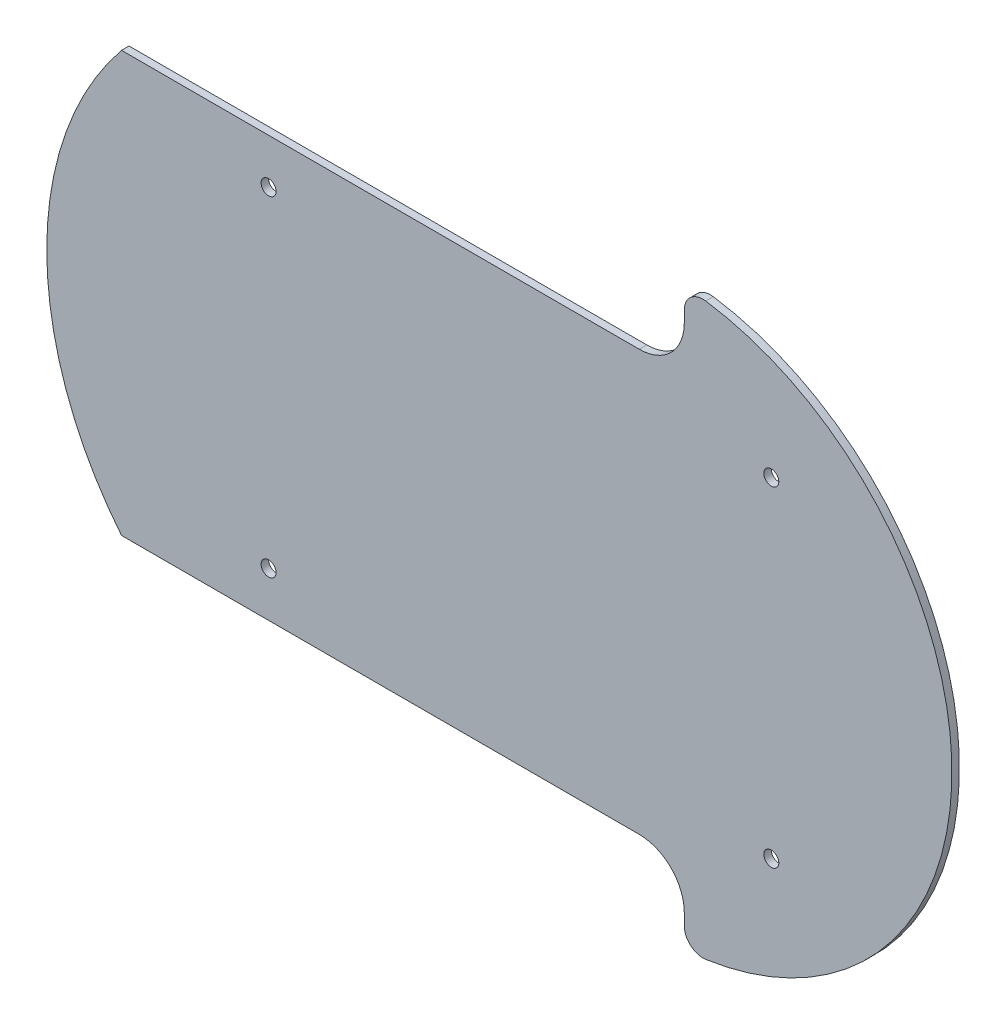
ISO-10303-21;
HEADER;
FILE_DESCRIPTION(('STEP AP214'),'2;1');
FILE_NAME('part.step','',(''),(''),'','','');
FILE_SCHEMA(('AUTOMOTIVE_DESIGN { 1 0 10303 214 1 1 1 1 }'));
ENDSEC;
DATA;
#1=APPLICATION_CONTEXT('core data for automotive mechanical design processes');
#2=APPLICATION_PROTOCOL_DEFINITION('international standard','automotive_design',2000,#1);
#3=PRODUCT_CONTEXT('',#1,'mechanical');
#4=PRODUCT('Part','Part','',(#3));
#5=PRODUCT_RELATED_PRODUCT_CATEGORY('part','',(#4));
#6=PRODUCT_DEFINITION_FORMATION('','',#4);
#7=PRODUCT_DEFINITION_CONTEXT('part definition',#1,'design');
#8=PRODUCT_DEFINITION('design','',#6,#7);
#9=PRODUCT_DEFINITION_SHAPE('','',#8);
#10=(LENGTH_UNIT() NAMED_UNIT(*) SI_UNIT(.MILLI.,.METRE.));
#11=(NAMED_UNIT(*) PLANE_ANGLE_UNIT() SI_UNIT($,.RADIAN.));
#12=(NAMED_UNIT(*) SI_UNIT($,.STERADIAN.) SOLID_ANGLE_UNIT());
#13=UNCERTAINTY_MEASURE_WITH_UNIT(LENGTH_MEASURE(1.E-05),#10,'distance_accuracy_value','');
#14=(GEOMETRIC_REPRESENTATION_CONTEXT(3) GLOBAL_UNCERTAINTY_ASSIGNED_CONTEXT((#13)) GLOBAL_UNIT_ASSIGNED_CONTEXT((#10,
#11,#12)) REPRESENTATION_CONTEXT('',''));
#15=CARTESIAN_POINT('',(0.,0.,0.));
#16=DIRECTION('',(0.,0.,1.));
#17=DIRECTION('',(1.,0.,0.));
#18=AXIS2_PLACEMENT_3D('',#15,#16,#17);
#19=CARTESIAN_POINT('',(48.8010102041222,71.0533507693043,2.));
#20=DIRECTION('',(0.,0.,-1.));
#21=DIRECTION('',(-1.,0.,0.));
#22=AXIS2_PLACEMENT_3D('',#19,#20,#21);
#23=PLANE('',#22);
#24=CARTESIAN_POINT('',(48.8010102041222,71.0533507693043,2.));
#25=DIRECTION('',(0.,0.,1.));
#26=DIRECTION('',(-1.,0.,0.));
#27=AXIS2_PLACEMENT_3D('',#24,#25,#26);
#28=CIRCLE('',#27,5.);
#29=CARTESIAN_POINT('',(49.5294752948833,76.,2.));
#30=VERTEX_POINT('',#29);
#31=CARTESIAN_POINT('',(43.8010102041222,71.0533507693043,2.));
#32=VERTEX_POINT('',#31);
#33=EDGE_CURVE('E161',#30,#32,#28,.T.);
#34=ORIENTED_EDGE('',*,*,#33,.T.);
#35=DIRECTION('',(0.,-1.,0.));
#36=VECTOR('',#35,1.);
#37=CARTESIAN_POINT('',(43.8010102041222,68.,2.));
#38=LINE('',#37,#36);
#39=CARTESIAN_POINT('',(43.8010102041222,68.,2.));
#40=VERTEX_POINT('',#39);
#41=EDGE_CURVE('E99',#32,#40,#38,.T.);
#42=ORIENTED_EDGE('',*,*,#41,.T.);
#43=CARTESIAN_POINT('',(31.8010102041222,68.,2.));
#44=DIRECTION('',(0.,0.,-1.));
#45=DIRECTION('',(1.,0.,0.));
#46=AXIS2_PLACEMENT_3D('',#43,#44,#45);
#47=CIRCLE('',#46,12.);
#48=CARTESIAN_POINT('',(31.8010102041222,56.,2.));
#49=VERTEX_POINT('',#48);
#50=EDGE_CURVE('E182',#40,#49,#47,.T.);
#51=ORIENTED_EDGE('',*,*,#50,.T.);
#52=DIRECTION('',(-1.,0.,0.));
#53=VECTOR('',#52,1.);
#54=CARTESIAN_POINT('',(-106.198989795878,56.,2.));
#55=LINE('',#54,#53);
#56=CARTESIAN_POINT('',(-106.198989795878,56.,2.));
#57=VERTEX_POINT('',#56);
#58=EDGE_CURVE('E201',#49,#57,#55,.T.);
#59=ORIENTED_EDGE('',*,*,#58,.T.);
#60=CARTESIAN_POINT('',(-37.5,0.,2.));
#61=DIRECTION('',(0.,0.,1.));
#62=DIRECTION('',(-1.,0.,0.));
#63=AXIS2_PLACEMENT_3D('',#60,#61,#62);
#64=CIRCLE('',#63,88.6315474251359);
#65=CARTESIAN_POINT('',(-106.198989795878,-56.,2.));
#66=VERTEX_POINT('',#65);
#67=EDGE_CURVE('E198',#57,#66,#64,.T.);
#68=ORIENTED_EDGE('',*,*,#67,.T.);
#69=DIRECTION('',(1.,0.,0.));
#70=VECTOR('',#69,1.);
#71=CARTESIAN_POINT('',(-106.198989795878,-56.,2.));
#72=LINE('',#71,#70);
#73=CARTESIAN_POINT('',(31.8010102041222,-56.,2.));
#74=VERTEX_POINT('',#73);
#75=EDGE_CURVE('E200',#66,#74,#72,.T.);
#76=ORIENTED_EDGE('',*,*,#75,.T.);
#77=CARTESIAN_POINT('',(31.8010102041222,-68.,2.));
#78=DIRECTION('',(0.,0.,-1.));
#79=DIRECTION('',(1.,0.,0.));
#80=AXIS2_PLACEMENT_3D('',#77,#78,#79);
#81=CIRCLE('',#80,12.);
#82=CARTESIAN_POINT('',(43.8010102041222,-68.,2.));
#83=VERTEX_POINT('',#82);
#84=EDGE_CURVE('E124',#74,#83,#81,.T.);
#85=ORIENTED_EDGE('',*,*,#84,.T.);
#86=DIRECTION('',(0.,-1.,0.));
#87=VECTOR('',#86,1.);
#88=CARTESIAN_POINT('',(43.8010102041222,-68.,2.));
#89=LINE('',#88,#87);
#90=CARTESIAN_POINT('',(43.8010102041222,-71.0533507693043,2.));
#91=VERTEX_POINT('',#90);
#92=EDGE_CURVE('E118',#83,#91,#89,.T.);
#93=ORIENTED_EDGE('',*,*,#92,.T.);
#94=CARTESIAN_POINT('',(48.8010102041222,-71.0533507693043,2.));
#95=DIRECTION('',(0.,0.,1.));
#96=DIRECTION('',(1.,0.,0.));
#97=AXIS2_PLACEMENT_3D('',#94,#95,#96);
#98=CIRCLE('',#97,5.00000000000005);
#99=CARTESIAN_POINT('',(49.5294752948833,-76.,2.));
#100=VERTEX_POINT('',#99);
#101=EDGE_CURVE('E122',#91,#100,#98,.T.);
#102=ORIENTED_EDGE('',*,*,#101,.T.);
#103=CARTESIAN_POINT('',(38.337384585421,0.,2.));
#104=DIRECTION('',(0.,0.,1.));
#105=DIRECTION('',(-1.,0.,0.));
#106=AXIS2_PLACEMENT_3D('',#103,#104,#105);
#107=CIRCLE('',#106,76.8196777814697);
#108=EDGE_CURVE('E50',#100,#30,#107,.T.);
#109=ORIENTED_EDGE('',*,*,#108,.T.);
#110=EDGE_LOOP('',(#34,#42,#51,#59,#68,#76,#85,#93,#102,#109));
#111=FACE_BOUND('',#110,.T.);
#112=CARTESIAN_POINT('',(67.,44.,2.));
#113=DIRECTION('',(0.,0.,1.));
#114=DIRECTION('',(1.,0.,0.));
#115=AXIS2_PLACEMENT_3D('',#112,#113,#114);
#116=CIRCLE('',#115,2.);
#117=CARTESIAN_POINT('',(69.,44.,2.));
#118=VERTEX_POINT('',#117);
#119=EDGE_CURVE('E146',#118,#118,#116,.T.);
#120=ORIENTED_EDGE('',*,*,#119,.F.);
#121=EDGE_LOOP('',(#120));
#122=FACE_BOUND('',#121,.T.);
#123=CARTESIAN_POINT('',(67.,-44.,2.));
#124=DIRECTION('',(0.,0.,1.));
#125=DIRECTION('',(1.,0.,0.));
#126=AXIS2_PLACEMENT_3D('',#123,#124,#125);
#127=CIRCLE('',#126,2.);
#128=CARTESIAN_POINT('',(69.,-44.,2.));
#129=VERTEX_POINT('',#128);
#130=EDGE_CURVE('E212',#129,#129,#127,.T.);
#131=ORIENTED_EDGE('',*,*,#130,.F.);
#132=EDGE_LOOP('',(#131));
#133=FACE_BOUND('',#132,.T.);
#134=CARTESIAN_POINT('',(-67.,44.,2.));
#135=DIRECTION('',(0.,0.,1.));
#136=DIRECTION('',(1.,0.,0.));
#137=AXIS2_PLACEMENT_3D('',#134,#135,#136);
#138=CIRCLE('',#137,2.);
#139=CARTESIAN_POINT('',(-65.,44.,2.));
#140=VERTEX_POINT('',#139);
#141=EDGE_CURVE('E218',#140,#140,#138,.T.);
#142=ORIENTED_EDGE('',*,*,#141,.F.);
#143=EDGE_LOOP('',(#142));
#144=FACE_BOUND('',#143,.T.);
#145=CARTESIAN_POINT('',(-67.,-44.,2.));
#146=DIRECTION('',(0.,0.,1.));
#147=DIRECTION('',(1.,0.,0.));
#148=AXIS2_PLACEMENT_3D('',#145,#146,#147);
#149=CIRCLE('',#148,2.);
#150=CARTESIAN_POINT('',(-65.,-44.,2.));
#151=VERTEX_POINT('',#150);
#152=EDGE_CURVE('E224',#151,#151,#149,.T.);
#153=ORIENTED_EDGE('',*,*,#152,.F.);
#154=EDGE_LOOP('',(#153));
#155=FACE_BOUND('',#154,.T.);
#156=ADVANCED_FACE('F33',(#111,#122,#133,#144,#155),#23,.F.);
#157=CARTESIAN_POINT('',(48.8010102041222,71.0533507693043,0.));
#158=DIRECTION('',(0.,0.,-1.));
#159=DIRECTION('',(-1.,0.,0.));
#160=AXIS2_PLACEMENT_3D('',#157,#158,#159);
#161=PLANE('',#160);
#162=CARTESIAN_POINT('',(-67.,44.,0.));
#163=DIRECTION('',(0.,0.,1.));
#164=DIRECTION('',(1.,0.,0.));
#165=AXIS2_PLACEMENT_3D('',#162,#163,#164);
#166=CIRCLE('',#165,2.);
#167=CARTESIAN_POINT('',(-65.,44.,0.));
#168=VERTEX_POINT('',#167);
#169=EDGE_CURVE('E221',#168,#168,#166,.T.);
#170=ORIENTED_EDGE('',*,*,#169,.T.);
#171=EDGE_LOOP('',(#170));
#172=FACE_BOUND('',#171,.T.);
#173=CARTESIAN_POINT('',(67.,44.,0.));
#174=DIRECTION('',(0.,0.,1.));
#175=DIRECTION('',(1.,0.,0.));
#176=AXIS2_PLACEMENT_3D('',#173,#174,#175);
#177=CIRCLE('',#176,2.);
#178=CARTESIAN_POINT('',(69.,44.,0.));
#179=VERTEX_POINT('',#178);
#180=EDGE_CURVE('E209',#179,#179,#177,.T.);
#181=ORIENTED_EDGE('',*,*,#180,.T.);
#182=EDGE_LOOP('',(#181));
#183=FACE_BOUND('',#182,.T.);
#184=CARTESIAN_POINT('',(48.8010102041222,71.0533507693043,0.));
#185=DIRECTION('',(0.,0.,1.));
#186=DIRECTION('',(-1.,0.,0.));
#187=AXIS2_PLACEMENT_3D('',#184,#185,#186);
#188=CIRCLE('',#187,5.);
#189=CARTESIAN_POINT('',(49.5294752948833,76.,0.));
#190=VERTEX_POINT('',#189);
#191=CARTESIAN_POINT('',(43.8010102041222,71.0533507693043,0.));
#192=VERTEX_POINT('',#191);
#193=EDGE_CURVE('E142',#190,#192,#188,.T.);
#194=ORIENTED_EDGE('',*,*,#193,.F.);
#195=CARTESIAN_POINT('',(38.337384585421,0.,0.));
#196=DIRECTION('',(0.,0.,1.));
#197=DIRECTION('',(-1.,0.,0.));
#198=AXIS2_PLACEMENT_3D('',#195,#196,#197);
#199=CIRCLE('',#198,76.8196777814697);
#200=CARTESIAN_POINT('',(49.5294752948833,-76.,0.));
#201=VERTEX_POINT('',#200);
#202=EDGE_CURVE('E91',#201,#190,#199,.T.);
#203=ORIENTED_EDGE('',*,*,#202,.F.);
#204=CARTESIAN_POINT('',(48.8010102041222,-71.0533507693043,0.));
#205=DIRECTION('',(0.,0.,1.));
#206=DIRECTION('',(1.,0.,0.));
#207=AXIS2_PLACEMENT_3D('',#204,#205,#206);
#208=CIRCLE('',#207,5.00000000000005);
#209=CARTESIAN_POINT('',(43.8010102041222,-71.0533507693043,0.));
#210=VERTEX_POINT('',#209);
#211=EDGE_CURVE('E85',#210,#201,#208,.T.);
#212=ORIENTED_EDGE('',*,*,#211,.F.);
#213=DIRECTION('',(0.,-1.,0.));
#214=VECTOR('',#213,1.);
#215=CARTESIAN_POINT('',(43.8010102041222,-68.,0.));
#216=LINE('',#215,#214);
#217=CARTESIAN_POINT('',(43.8010102041222,-68.,0.));
#218=VERTEX_POINT('',#217);
#219=EDGE_CURVE('E132',#218,#210,#216,.T.);
#220=ORIENTED_EDGE('',*,*,#219,.F.);
#221=CARTESIAN_POINT('',(31.8010102041222,-68.,0.));
#222=DIRECTION('',(0.,0.,-1.));
#223=DIRECTION('',(1.,0.,0.));
#224=AXIS2_PLACEMENT_3D('',#221,#222,#223);
#225=CIRCLE('',#224,12.);
#226=CARTESIAN_POINT('',(31.8010102041222,-56.,0.));
#227=VERTEX_POINT('',#226);
#228=EDGE_CURVE('E156',#227,#218,#225,.T.);
#229=ORIENTED_EDGE('',*,*,#228,.F.);
#230=DIRECTION('',(1.,0.,0.));
#231=VECTOR('',#230,1.);
#232=CARTESIAN_POINT('',(-106.198989795878,-56.,0.));
#233=LINE('',#232,#231);
#234=CARTESIAN_POINT('',(-106.198989795878,-56.,0.));
#235=VERTEX_POINT('',#234);
#236=EDGE_CURVE('E154',#235,#227,#233,.T.);
#237=ORIENTED_EDGE('',*,*,#236,.F.);
#238=CARTESIAN_POINT('',(-37.5,0.,0.));
#239=DIRECTION('',(0.,0.,1.));
#240=DIRECTION('',(-1.,0.,0.));
#241=AXIS2_PLACEMENT_3D('',#238,#239,#240);
#242=CIRCLE('',#241,88.6315474251359);
#243=CARTESIAN_POINT('',(-106.198989795878,56.,0.));
#244=VERTEX_POINT('',#243);
#245=EDGE_CURVE('E152',#244,#235,#242,.T.);
#246=ORIENTED_EDGE('',*,*,#245,.F.);
#247=DIRECTION('',(-1.,0.,0.));
#248=VECTOR('',#247,1.);
#249=CARTESIAN_POINT('',(-106.198989795878,56.,0.));
#250=LINE('',#249,#248);
#251=CARTESIAN_POINT('',(31.8010102041222,56.,0.));
#252=VERTEX_POINT('',#251);
#253=EDGE_CURVE('E150',#252,#244,#250,.T.);
#254=ORIENTED_EDGE('',*,*,#253,.F.);
#255=CARTESIAN_POINT('',(31.8010102041222,68.,0.));
#256=DIRECTION('',(0.,0.,-1.));
#257=DIRECTION('',(1.,0.,0.));
#258=AXIS2_PLACEMENT_3D('',#255,#256,#257);
#259=CIRCLE('',#258,12.);
#260=CARTESIAN_POINT('',(43.8010102041222,68.,0.));
#261=VERTEX_POINT('',#260);
#262=EDGE_CURVE('E148',#261,#252,#259,.T.);
#263=ORIENTED_EDGE('',*,*,#262,.F.);
#264=DIRECTION('',(0.,-1.,0.));
#265=VECTOR('',#264,1.);
#266=CARTESIAN_POINT('',(43.8010102041222,68.,0.));
#267=LINE('',#266,#265);
#268=EDGE_CURVE('E145',#192,#261,#267,.T.);
#269=ORIENTED_EDGE('',*,*,#268,.F.);
#270=EDGE_LOOP('',(#194,#203,#212,#220,#229,#237,#246,#254,#263,#269));
#271=FACE_BOUND('',#270,.T.);
#272=CARTESIAN_POINT('',(67.,-44.,0.));
#273=DIRECTION('',(0.,0.,1.));
#274=DIRECTION('',(1.,0.,0.));
#275=AXIS2_PLACEMENT_3D('',#272,#273,#274);
#276=CIRCLE('',#275,2.);
#277=CARTESIAN_POINT('',(69.,-44.,0.));
#278=VERTEX_POINT('',#277);
#279=EDGE_CURVE('E215',#278,#278,#276,.T.);
#280=ORIENTED_EDGE('',*,*,#279,.T.);
#281=EDGE_LOOP('',(#280));
#282=FACE_BOUND('',#281,.T.);
#283=CARTESIAN_POINT('',(-67.,-44.,0.));
#284=DIRECTION('',(0.,0.,1.));
#285=DIRECTION('',(1.,0.,0.));
#286=AXIS2_PLACEMENT_3D('',#283,#284,#285);
#287=CIRCLE('',#286,2.);
#288=CARTESIAN_POINT('',(-65.,-44.,0.));
#289=VERTEX_POINT('',#288);
#290=EDGE_CURVE('E227',#289,#289,#287,.T.);
#291=ORIENTED_EDGE('',*,*,#290,.T.);
#292=EDGE_LOOP('',(#291));
#293=FACE_BOUND('',#292,.T.);
#294=ADVANCED_FACE('F186',(#172,#183,#271,#282,#293),#161,.T.);
#295=CARTESIAN_POINT('',(48.8010102041222,71.0533507693043,2.));
#296=DIRECTION('',(0.,0.,-1.));
#297=DIRECTION('',(-1.,0.,0.));
#298=AXIS2_PLACEMENT_3D('',#295,#296,#297);
#299=CYLINDRICAL_SURFACE('',#298,5.);
#300=ORIENTED_EDGE('',*,*,#193,.T.);
#301=DIRECTION('',(0.,0.,-1.));
#302=VECTOR('',#301,1.);
#303=CARTESIAN_POINT('',(43.8010102041222,71.0533507693043,2.));
#304=LINE('',#303,#302);
#305=EDGE_CURVE('E11',#32,#192,#304,.T.);
#306=ORIENTED_EDGE('',*,*,#305,.F.);
#307=ORIENTED_EDGE('',*,*,#33,.F.);
#308=DIRECTION('',(0.,0.,-1.));
#309=VECTOR('',#308,1.);
#310=CARTESIAN_POINT('',(49.5294752948833,76.,2.));
#311=LINE('',#310,#309);
#312=EDGE_CURVE('E138',#30,#190,#311,.T.);
#313=ORIENTED_EDGE('',*,*,#312,.T.);
#314=EDGE_LOOP('',(#300,#306,#307,#313));
#315=FACE_BOUND('',#314,.T.);
#316=ADVANCED_FACE('F35',(#315),#299,.T.);
#317=CARTESIAN_POINT('',(43.8010102041222,68.,2.));
#318=DIRECTION('',(1.,0.,0.));
#319=DIRECTION('',(0.,1.,0.));
#320=AXIS2_PLACEMENT_3D('',#317,#318,#319);
#321=PLANE('',#320);
#322=ORIENTED_EDGE('',*,*,#268,.T.);
#323=DIRECTION('',(0.,0.,-1.));
#324=VECTOR('',#323,1.);
#325=CARTESIAN_POINT('',(43.8010102041222,68.,2.));
#326=LINE('',#325,#324);
#327=EDGE_CURVE('E42',#40,#261,#326,.T.);
#328=ORIENTED_EDGE('',*,*,#327,.F.);
#329=ORIENTED_EDGE('',*,*,#41,.F.);
#330=ORIENTED_EDGE('',*,*,#305,.T.);
#331=EDGE_LOOP('',(#322,#328,#329,#330));
#332=FACE_BOUND('',#331,.T.);
#333=ADVANCED_FACE('F267',(#332),#321,.F.);
#334=CARTESIAN_POINT('',(31.8010102041222,68.,2.));
#335=DIRECTION('',(0.,0.,-1.));
#336=DIRECTION('',(-1.,0.,0.));
#337=AXIS2_PLACEMENT_3D('',#334,#335,#336);
#338=CYLINDRICAL_SURFACE('',#337,12.);
#339=ORIENTED_EDGE('',*,*,#262,.T.);
#340=DIRECTION('',(0.,0.,-1.));
#341=VECTOR('',#340,1.);
#342=CARTESIAN_POINT('',(31.8010102041222,56.,2.));
#343=LINE('',#342,#341);
#344=EDGE_CURVE('E174',#49,#252,#343,.T.);
#345=ORIENTED_EDGE('',*,*,#344,.F.);
#346=ORIENTED_EDGE('',*,*,#50,.F.);
#347=ORIENTED_EDGE('',*,*,#327,.T.);
#348=EDGE_LOOP('',(#339,#345,#346,#347));
#349=FACE_BOUND('',#348,.T.);
#350=ADVANCED_FACE('F180',(#349),#338,.F.);
#351=CARTESIAN_POINT('',(-106.198989795878,56.,2.));
#352=DIRECTION('',(0.,-1.,0.));
#353=DIRECTION('',(0.,0.,-1.));
#354=AXIS2_PLACEMENT_3D('',#351,#352,#353);
#355=PLANE('',#354);
#356=ORIENTED_EDGE('',*,*,#253,.T.);
#357=DIRECTION('',(0.,0.,-1.));
#358=VECTOR('',#357,1.);
#359=CARTESIAN_POINT('',(-106.198989795878,56.,2.));
#360=LINE('',#359,#358);
#361=EDGE_CURVE('E171',#57,#244,#360,.T.);
#362=ORIENTED_EDGE('',*,*,#361,.F.);
#363=ORIENTED_EDGE('',*,*,#58,.F.);
#364=ORIENTED_EDGE('',*,*,#344,.T.);
#365=EDGE_LOOP('',(#356,#362,#363,#364));
#366=FACE_BOUND('',#365,.T.);
#367=ADVANCED_FACE('F192',(#366),#355,.F.);
#368=CARTESIAN_POINT('',(-37.5,0.,2.));
#369=DIRECTION('',(0.,0.,-1.));
#370=DIRECTION('',(-1.,0.,0.));
#371=AXIS2_PLACEMENT_3D('',#368,#369,#370);
#372=CYLINDRICAL_SURFACE('',#371,88.6315474251359);
#373=ORIENTED_EDGE('',*,*,#245,.T.);
#374=DIRECTION('',(0.,0.,-1.));
#375=VECTOR('',#374,1.);
#376=CARTESIAN_POINT('',(-106.198989795878,-56.,2.));
#377=LINE('',#376,#375);
#378=EDGE_CURVE('E168',#66,#235,#377,.T.);
#379=ORIENTED_EDGE('',*,*,#378,.F.);
#380=ORIENTED_EDGE('',*,*,#67,.F.);
#381=ORIENTED_EDGE('',*,*,#361,.T.);
#382=EDGE_LOOP('',(#373,#379,#380,#381));
#383=FACE_BOUND('',#382,.T.);
#384=ADVANCED_FACE('F196',(#383),#372,.T.);
#385=CARTESIAN_POINT('',(-106.198989795878,-56.,2.));
#386=DIRECTION('',(0.,1.,0.));
#387=DIRECTION('',(-1.,0.,0.));
#388=AXIS2_PLACEMENT_3D('',#385,#386,#387);
#389=PLANE('',#388);
#390=ORIENTED_EDGE('',*,*,#236,.T.);
#391=DIRECTION('',(0.,0.,-1.));
#392=VECTOR('',#391,1.);
#393=CARTESIAN_POINT('',(31.8010102041222,-56.,2.));
#394=LINE('',#393,#392);
#395=EDGE_CURVE('E165',#74,#227,#394,.T.);
#396=ORIENTED_EDGE('',*,*,#395,.F.);
#397=ORIENTED_EDGE('',*,*,#75,.F.);
#398=ORIENTED_EDGE('',*,*,#378,.T.);
#399=EDGE_LOOP('',(#390,#396,#397,#398));
#400=FACE_BOUND('',#399,.T.);
#401=ADVANCED_FACE('F257',(#400),#389,.F.);
#402=CARTESIAN_POINT('',(31.8010102041222,-68.,2.));
#403=DIRECTION('',(0.,0.,-1.));
#404=DIRECTION('',(-1.,0.,0.));
#405=AXIS2_PLACEMENT_3D('',#402,#403,#404);
#406=CYLINDRICAL_SURFACE('',#405,12.);
#407=ORIENTED_EDGE('',*,*,#228,.T.);
#408=DIRECTION('',(0.,0.,-1.));
#409=VECTOR('',#408,1.);
#410=CARTESIAN_POINT('',(43.8010102041222,-68.,2.));
#411=LINE('',#410,#409);
#412=EDGE_CURVE('E133',#83,#218,#411,.T.);
#413=ORIENTED_EDGE('',*,*,#412,.F.);
#414=ORIENTED_EDGE('',*,*,#84,.F.);
#415=ORIENTED_EDGE('',*,*,#395,.T.);
#416=EDGE_LOOP('',(#407,#413,#414,#415));
#417=FACE_BOUND('',#416,.T.);
#418=ADVANCED_FACE('F254',(#417),#406,.F.);
#419=CARTESIAN_POINT('',(43.8010102041222,-68.,2.));
#420=DIRECTION('',(1.,0.,0.));
#421=DIRECTION('',(0.,0.,-1.));
#422=AXIS2_PLACEMENT_3D('',#419,#420,#421);
#423=PLANE('',#422);
#424=ORIENTED_EDGE('',*,*,#219,.T.);
#425=DIRECTION('',(0.,0.,-1.));
#426=VECTOR('',#425,1.);
#427=CARTESIAN_POINT('',(43.8010102041222,-71.0533507693043,2.));
#428=LINE('',#427,#426);
#429=EDGE_CURVE('E129',#91,#210,#428,.T.);
#430=ORIENTED_EDGE('',*,*,#429,.F.);
#431=ORIENTED_EDGE('',*,*,#92,.F.);
#432=ORIENTED_EDGE('',*,*,#412,.T.);
#433=EDGE_LOOP('',(#424,#430,#431,#432));
#434=FACE_BOUND('',#433,.T.);
#435=ADVANCED_FACE('F130',(#434),#423,.F.);
#436=CARTESIAN_POINT('',(48.8010102041222,-71.0533507693043,2.));
#437=DIRECTION('',(0.,0.,-1.));
#438=DIRECTION('',(-1.,0.,0.));
#439=AXIS2_PLACEMENT_3D('',#436,#437,#438);
#440=CYLINDRICAL_SURFACE('',#439,5.00000000000005);
#441=ORIENTED_EDGE('',*,*,#211,.T.);
#442=DIRECTION('',(0.,0.,-1.));
#443=VECTOR('',#442,1.);
#444=CARTESIAN_POINT('',(49.5294752948833,-76.,2.));
#445=LINE('',#444,#443);
#446=EDGE_CURVE('E134',#100,#201,#445,.T.);
#447=ORIENTED_EDGE('',*,*,#446,.F.);
#448=ORIENTED_EDGE('',*,*,#101,.F.);
#449=ORIENTED_EDGE('',*,*,#429,.T.);
#450=EDGE_LOOP('',(#441,#447,#448,#449));
#451=FACE_BOUND('',#450,.T.);
#452=ADVANCED_FACE('F136',(#451),#440,.T.);
#453=CARTESIAN_POINT('',(38.337384585421,0.,2.));
#454=DIRECTION('',(0.,0.,-1.));
#455=DIRECTION('',(-1.,0.,0.));
#456=AXIS2_PLACEMENT_3D('',#453,#454,#455);
#457=CYLINDRICAL_SURFACE('',#456,76.8196777814697);
#458=ORIENTED_EDGE('',*,*,#202,.T.);
#459=ORIENTED_EDGE('',*,*,#312,.F.);
#460=ORIENTED_EDGE('',*,*,#108,.F.);
#461=ORIENTED_EDGE('',*,*,#446,.T.);
#462=EDGE_LOOP('',(#458,#459,#460,#461));
#463=FACE_BOUND('',#462,.T.);
#464=ADVANCED_FACE('F247',(#463),#457,.T.);
#465=CARTESIAN_POINT('',(67.,44.,2.));
#466=DIRECTION('',(0.,0.,-1.));
#467=DIRECTION('',(-1.,0.,0.));
#468=AXIS2_PLACEMENT_3D('',#465,#466,#467);
#469=CYLINDRICAL_SURFACE('',#468,2.);
#470=ORIENTED_EDGE('',*,*,#119,.T.);
#471=EDGE_LOOP('',(#470));
#472=FACE_BOUND('',#471,.T.);
#473=ORIENTED_EDGE('',*,*,#180,.F.);
#474=EDGE_LOOP('',(#473));
#475=FACE_BOUND('',#474,.T.);
#476=ADVANCED_FACE('F244',(#472,#475),#469,.F.);
#477=CARTESIAN_POINT('',(67.,-44.,2.));
#478=DIRECTION('',(0.,0.,-1.));
#479=DIRECTION('',(-1.,0.,0.));
#480=AXIS2_PLACEMENT_3D('',#477,#478,#479);
#481=CYLINDRICAL_SURFACE('',#480,2.);
#482=ORIENTED_EDGE('',*,*,#130,.T.);
#483=EDGE_LOOP('',(#482));
#484=FACE_BOUND('',#483,.T.);
#485=ORIENTED_EDGE('',*,*,#279,.F.);
#486=EDGE_LOOP('',(#485));
#487=FACE_BOUND('',#486,.T.);
#488=ADVANCED_FACE('F343',(#484,#487),#481,.F.);
#489=CARTESIAN_POINT('',(-67.,44.,2.));
#490=DIRECTION('',(0.,0.,-1.));
#491=DIRECTION('',(-1.,0.,0.));
#492=AXIS2_PLACEMENT_3D('',#489,#490,#491);
#493=CYLINDRICAL_SURFACE('',#492,2.);
#494=ORIENTED_EDGE('',*,*,#141,.T.);
#495=EDGE_LOOP('',(#494));
#496=FACE_BOUND('',#495,.T.);
#497=ORIENTED_EDGE('',*,*,#169,.F.);
#498=EDGE_LOOP('',(#497));
#499=FACE_BOUND('',#498,.T.);
#500=ADVANCED_FACE('F351',(#496,#499),#493,.F.);
#501=CARTESIAN_POINT('',(-67.,-44.,2.));
#502=DIRECTION('',(0.,0.,-1.));
#503=DIRECTION('',(-1.,0.,0.));
#504=AXIS2_PLACEMENT_3D('',#501,#502,#503);
#505=CYLINDRICAL_SURFACE('',#504,2.);
#506=ORIENTED_EDGE('',*,*,#152,.T.);
#507=EDGE_LOOP('',(#506));
#508=FACE_BOUND('',#507,.T.);
#509=ORIENTED_EDGE('',*,*,#290,.F.);
#510=EDGE_LOOP('',(#509));
#511=FACE_BOUND('',#510,.T.);
#512=ADVANCED_FACE('F233',(#508,#511),#505,.F.);
#513=CLOSED_SHELL('',(#156,#294,#316,#333,#350,#367,#384,#401,#418,#435,#452,#464,#476,#488,
#500,#512));
#514=MANIFOLD_SOLID_BREP('B2',#513);
#515=ADVANCED_BREP_SHAPE_REPRESENTATION('',(#18,#514),#14);
#516=SHAPE_DEFINITION_REPRESENTATION(#9,#515);
ENDSEC;
END-ISO-10303-21;
